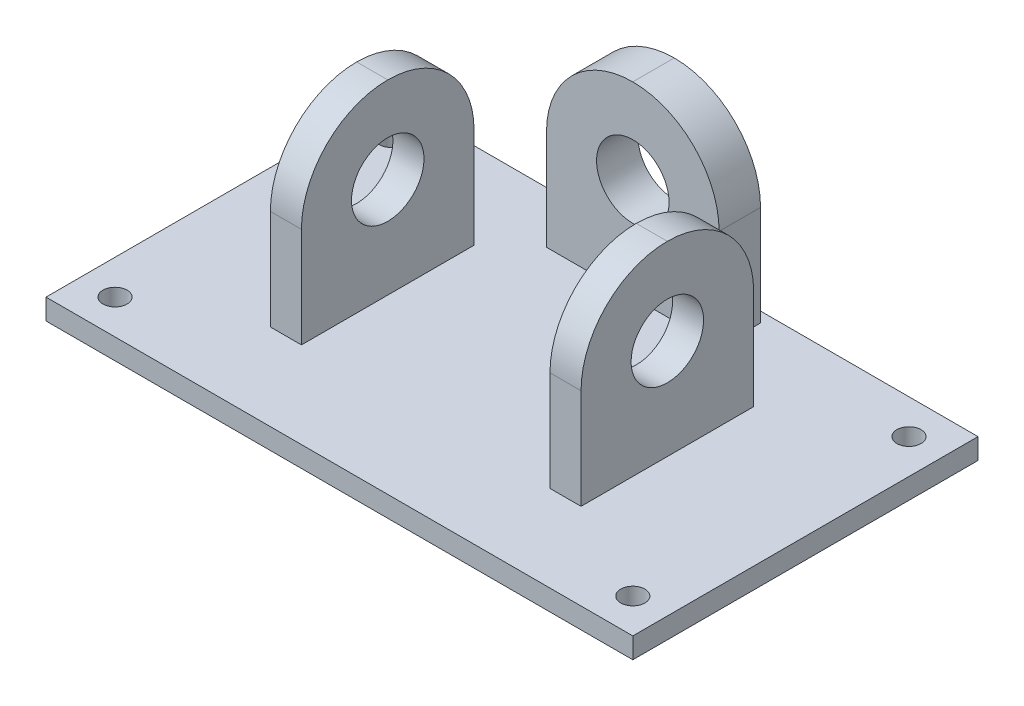
ISO-10303-21;
HEADER;
FILE_DESCRIPTION(('STEP AP214'),'2;1');
FILE_NAME('part.step','',(''),(''),'','','');
FILE_SCHEMA(('AUTOMOTIVE_DESIGN { 1 0 10303 214 1 1 1 1 }'));
ENDSEC;
DATA;
#1=APPLICATION_CONTEXT('core data for automotive mechanical design processes');
#2=APPLICATION_PROTOCOL_DEFINITION('international standard','automotive_design',2000,#1);
#3=PRODUCT_CONTEXT('',#1,'mechanical');
#4=PRODUCT('Part','Part','',(#3));
#5=PRODUCT_RELATED_PRODUCT_CATEGORY('part','',(#4));
#6=PRODUCT_DEFINITION_FORMATION('','',#4);
#7=PRODUCT_DEFINITION_CONTEXT('part definition',#1,'design');
#8=PRODUCT_DEFINITION('design','',#6,#7);
#9=PRODUCT_DEFINITION_SHAPE('','',#8);
#10=(LENGTH_UNIT() NAMED_UNIT(*) SI_UNIT(.MILLI.,.METRE.));
#11=(NAMED_UNIT(*) PLANE_ANGLE_UNIT() SI_UNIT($,.RADIAN.));
#12=(NAMED_UNIT(*) SI_UNIT($,.STERADIAN.) SOLID_ANGLE_UNIT());
#13=UNCERTAINTY_MEASURE_WITH_UNIT(LENGTH_MEASURE(1.E-05),#10,'distance_accuracy_value','');
#14=(GEOMETRIC_REPRESENTATION_CONTEXT(3) GLOBAL_UNCERTAINTY_ASSIGNED_CONTEXT((#13)) GLOBAL_UNIT_ASSIGNED_CONTEXT((#10,
#11,#12)) REPRESENTATION_CONTEXT('',''));
#15=CARTESIAN_POINT('',(0.,0.,0.));
#16=DIRECTION('',(0.,0.,1.));
#17=DIRECTION('',(1.,0.,0.));
#18=AXIS2_PLACEMENT_3D('',#15,#16,#17);
#19=CARTESIAN_POINT('',(0.,3.,0.));
#20=DIRECTION('',(0.,-1.,0.));
#21=DIRECTION('',(0.,0.,-1.));
#22=AXIS2_PLACEMENT_3D('',#19,#20,#21);
#23=PLANE('',#22);
#24=CARTESIAN_POINT('',(37.5,3.,-20.));
#25=DIRECTION('',(0.,1.,0.));
#26=DIRECTION('',(0.,0.,1.));
#27=AXIS2_PLACEMENT_3D('',#24,#25,#26);
#28=CIRCLE('',#27,1.75);
#29=CARTESIAN_POINT('',(37.5,3.,-18.25));
#30=VERTEX_POINT('',#29);
#31=EDGE_CURVE('E657',#30,#30,#28,.T.);
#32=ORIENTED_EDGE('',*,*,#31,.F.);
#33=EDGE_LOOP('',(#32));
#34=FACE_BOUND('',#33,.T.);
#35=CARTESIAN_POINT('',(37.5,3.,20.));
#36=DIRECTION('',(0.,1.,0.));
#37=DIRECTION('',(0.,0.,1.));
#38=AXIS2_PLACEMENT_3D('',#35,#36,#37);
#39=CIRCLE('',#38,1.75);
#40=CARTESIAN_POINT('',(37.5,3.,21.75));
#41=VERTEX_POINT('',#40);
#42=EDGE_CURVE('E665',#41,#41,#39,.T.);
#43=ORIENTED_EDGE('',*,*,#42,.F.);
#44=EDGE_LOOP('',(#43));
#45=FACE_BOUND('',#44,.T.);
#46=CARTESIAN_POINT('',(-37.5,3.,20.));
#47=DIRECTION('',(0.,1.,0.));
#48=DIRECTION('',(0.,0.,1.));
#49=AXIS2_PLACEMENT_3D('',#46,#47,#48);
#50=CIRCLE('',#49,1.75);
#51=CARTESIAN_POINT('',(-37.5,3.,21.75));
#52=VERTEX_POINT('',#51);
#53=EDGE_CURVE('E671',#52,#52,#50,.T.);
#54=ORIENTED_EDGE('',*,*,#53,.F.);
#55=EDGE_LOOP('',(#54));
#56=FACE_BOUND('',#55,.T.);
#57=DIRECTION('',(0.,0.,-1.));
#58=VECTOR('',#57,1.);
#59=CARTESIAN_POINT('',(12.5,3.,-17.5));
#60=LINE('',#59,#58);
#61=CARTESIAN_POINT('',(12.5,3.,-17.5));
#62=VERTEX_POINT('',#61);
#63=CARTESIAN_POINT('',(12.5,3.,-23.5));
#64=VERTEX_POINT('',#63);
#65=EDGE_CURVE('E196',#62,#64,#60,.T.);
#66=ORIENTED_EDGE('',*,*,#65,.F.);
#67=DIRECTION('',(1.,0.,0.));
#68=VECTOR('',#67,1.);
#69=CARTESIAN_POINT('',(-12.5,3.,-17.5));
#70=LINE('',#69,#68);
#71=CARTESIAN_POINT('',(-12.5,3.,-17.5));
#72=VERTEX_POINT('',#71);
#73=EDGE_CURVE('E205',#72,#62,#70,.T.);
#74=ORIENTED_EDGE('',*,*,#73,.F.);
#75=DIRECTION('',(0.,0.,1.));
#76=VECTOR('',#75,1.);
#77=CARTESIAN_POINT('',(-12.5,3.,-17.5));
#78=LINE('',#77,#76);
#79=CARTESIAN_POINT('',(-12.5,3.,-23.5));
#80=VERTEX_POINT('',#79);
#81=EDGE_CURVE('E202',#80,#72,#78,.T.);
#82=ORIENTED_EDGE('',*,*,#81,.F.);
#83=DIRECTION('',(-1.,0.,0.));
#84=VECTOR('',#83,1.);
#85=CARTESIAN_POINT('',(-12.5,3.,-23.5));
#86=LINE('',#85,#84);
#87=EDGE_CURVE('E199',#64,#80,#86,.T.);
#88=ORIENTED_EDGE('',*,*,#87,.F.);
#89=EDGE_LOOP('',(#66,#74,#82,#88));
#90=FACE_BOUND('',#89,.T.);
#91=DIRECTION('',(0.,0.,-1.));
#92=VECTOR('',#91,1.);
#93=CARTESIAN_POINT('',(42.5,3.,25.));
#94=LINE('',#93,#92);
#95=CARTESIAN_POINT('',(42.5,3.,25.));
#96=VERTEX_POINT('',#95);
#97=CARTESIAN_POINT('',(42.5,3.,-25.));
#98=VERTEX_POINT('',#97);
#99=EDGE_CURVE('E237',#96,#98,#94,.T.);
#100=ORIENTED_EDGE('',*,*,#99,.T.);
#101=DIRECTION('',(-1.,0.,0.));
#102=VECTOR('',#101,1.);
#103=CARTESIAN_POINT('',(-42.5,3.,-25.));
#104=LINE('',#103,#102);
#105=CARTESIAN_POINT('',(-42.5,3.,-25.));
#106=VERTEX_POINT('',#105);
#107=EDGE_CURVE('E240',#98,#106,#104,.T.);
#108=ORIENTED_EDGE('',*,*,#107,.T.);
#109=DIRECTION('',(0.,0.,1.));
#110=VECTOR('',#109,1.);
#111=CARTESIAN_POINT('',(-42.5,3.,25.));
#112=LINE('',#111,#110);
#113=CARTESIAN_POINT('',(-42.5,3.,25.));
#114=VERTEX_POINT('',#113);
#115=EDGE_CURVE('E243',#106,#114,#112,.T.);
#116=ORIENTED_EDGE('',*,*,#115,.T.);
#117=DIRECTION('',(1.,0.,0.));
#118=VECTOR('',#117,1.);
#119=CARTESIAN_POINT('',(-42.5,3.,25.));
#120=LINE('',#119,#118);
#121=EDGE_CURVE('E245',#114,#96,#120,.T.);
#122=ORIENTED_EDGE('',*,*,#121,.T.);
#123=EDGE_LOOP('',(#100,#108,#116,#122));
#124=FACE_BOUND('',#123,.T.);
#125=DIRECTION('',(0.,0.,-1.));
#126=VECTOR('',#125,1.);
#127=CARTESIAN_POINT('',(-18.,3.,-12.5));
#128=LINE('',#127,#126);
#129=CARTESIAN_POINT('',(-18.,3.,12.5));
#130=VERTEX_POINT('',#129);
#131=CARTESIAN_POINT('',(-18.,3.,-12.5));
#132=VERTEX_POINT('',#131);
#133=EDGE_CURVE('E216',#130,#132,#128,.T.);
#134=ORIENTED_EDGE('',*,*,#133,.F.);
#135=DIRECTION('',(1.,0.,0.));
#136=VECTOR('',#135,1.);
#137=CARTESIAN_POINT('',(-22.5,3.,12.5));
#138=LINE('',#137,#136);
#139=CARTESIAN_POINT('',(-22.5,3.,12.5));
#140=VERTEX_POINT('',#139);
#141=EDGE_CURVE('E225',#140,#130,#138,.T.);
#142=ORIENTED_EDGE('',*,*,#141,.F.);
#143=DIRECTION('',(0.,0.,1.));
#144=VECTOR('',#143,1.);
#145=CARTESIAN_POINT('',(-22.5,3.,-12.5));
#146=LINE('',#145,#144);
#147=CARTESIAN_POINT('',(-22.5,3.,-12.5));
#148=VERTEX_POINT('',#147);
#149=EDGE_CURVE('E222',#148,#140,#146,.T.);
#150=ORIENTED_EDGE('',*,*,#149,.F.);
#151=DIRECTION('',(-1.,0.,0.));
#152=VECTOR('',#151,1.);
#153=CARTESIAN_POINT('',(-22.5,3.,-12.5));
#154=LINE('',#153,#152);
#155=EDGE_CURVE('E219',#132,#148,#154,.T.);
#156=ORIENTED_EDGE('',*,*,#155,.F.);
#157=EDGE_LOOP('',(#134,#142,#150,#156));
#158=FACE_BOUND('',#157,.T.);
#159=DIRECTION('',(0.,0.,-1.));
#160=VECTOR('',#159,1.);
#161=CARTESIAN_POINT('',(22.5,3.,-12.5));
#162=LINE('',#161,#160);
#163=CARTESIAN_POINT('',(22.5,3.,12.5));
#164=VERTEX_POINT('',#163);
#165=CARTESIAN_POINT('',(22.5,3.,-12.5));
#166=VERTEX_POINT('',#165);
#167=EDGE_CURVE('E167',#164,#166,#162,.T.);
#168=ORIENTED_EDGE('',*,*,#167,.F.);
#169=DIRECTION('',(1.,0.,0.));
#170=VECTOR('',#169,1.);
#171=CARTESIAN_POINT('',(22.5,3.,12.5));
#172=LINE('',#171,#170);
#173=CARTESIAN_POINT('',(18.,3.,12.5));
#174=VERTEX_POINT('',#173);
#175=EDGE_CURVE('E172',#174,#164,#172,.T.);
#176=ORIENTED_EDGE('',*,*,#175,.F.);
#177=DIRECTION('',(0.,0.,1.));
#178=VECTOR('',#177,1.);
#179=CARTESIAN_POINT('',(18.,3.,-12.5));
#180=LINE('',#179,#178);
#181=CARTESIAN_POINT('',(18.,3.,-12.5));
#182=VERTEX_POINT('',#181);
#183=EDGE_CURVE('E186',#182,#174,#180,.T.);
#184=ORIENTED_EDGE('',*,*,#183,.F.);
#185=DIRECTION('',(-1.,0.,0.));
#186=VECTOR('',#185,1.);
#187=CARTESIAN_POINT('',(22.5,3.,-12.5));
#188=LINE('',#187,#186);
#189=EDGE_CURVE('E181',#166,#182,#188,.T.);
#190=ORIENTED_EDGE('',*,*,#189,.F.);
#191=EDGE_LOOP('',(#168,#176,#184,#190));
#192=FACE_BOUND('',#191,.T.);
#193=CARTESIAN_POINT('',(-37.5,3.,-20.));
#194=DIRECTION('',(0.,1.,0.));
#195=DIRECTION('',(0.,0.,1.));
#196=AXIS2_PLACEMENT_3D('',#193,#194,#195);
#197=CIRCLE('',#196,1.75);
#198=CARTESIAN_POINT('',(-37.5,3.,-18.25));
#199=VERTEX_POINT('',#198);
#200=EDGE_CURVE('E655',#199,#199,#197,.T.);
#201=ORIENTED_EDGE('',*,*,#200,.F.);
#202=EDGE_LOOP('',(#201));
#203=FACE_BOUND('',#202,.T.);
#204=ADVANCED_FACE('F37',(#34,#45,#56,#90,#124,#158,#192,#203),#23,.F.);
#205=CARTESIAN_POINT('',(42.5,3.,25.));
#206=DIRECTION('',(-1.,0.,0.));
#207=DIRECTION('',(0.,0.,1.));
#208=AXIS2_PLACEMENT_3D('',#205,#206,#207);
#209=PLANE('',#208);
#210=DIRECTION('',(0.,0.,-1.));
#211=VECTOR('',#210,1.);
#212=CARTESIAN_POINT('',(42.5,0.,25.));
#213=LINE('',#212,#211);
#214=CARTESIAN_POINT('',(42.5,0.,25.));
#215=VERTEX_POINT('',#214);
#216=CARTESIAN_POINT('',(42.5,0.,-25.));
#217=VERTEX_POINT('',#216);
#218=EDGE_CURVE('E236',#215,#217,#213,.T.);
#219=ORIENTED_EDGE('',*,*,#218,.T.);
#220=DIRECTION('',(0.,-1.,0.));
#221=VECTOR('',#220,1.);
#222=CARTESIAN_POINT('',(42.5,3.,-25.));
#223=LINE('',#222,#221);
#224=EDGE_CURVE('E263',#98,#217,#223,.T.);
#225=ORIENTED_EDGE('',*,*,#224,.F.);
#226=ORIENTED_EDGE('',*,*,#99,.F.);
#227=DIRECTION('',(0.,-1.,0.));
#228=VECTOR('',#227,1.);
#229=CARTESIAN_POINT('',(42.5,3.,25.));
#230=LINE('',#229,#228);
#231=EDGE_CURVE('E247',#96,#215,#230,.T.);
#232=ORIENTED_EDGE('',*,*,#231,.T.);
#233=EDGE_LOOP('',(#219,#225,#226,#232));
#234=FACE_BOUND('',#233,.T.);
#235=ADVANCED_FACE('F339',(#234),#209,.F.);
#236=CARTESIAN_POINT('',(-42.5,3.,-25.));
#237=DIRECTION('',(0.,0.,1.));
#238=DIRECTION('',(1.,0.,0.));
#239=AXIS2_PLACEMENT_3D('',#236,#237,#238);
#240=PLANE('',#239);
#241=DIRECTION('',(-1.,0.,0.));
#242=VECTOR('',#241,1.);
#243=CARTESIAN_POINT('',(-42.5,0.,-25.));
#244=LINE('',#243,#242);
#245=CARTESIAN_POINT('',(-42.5,0.,-25.));
#246=VERTEX_POINT('',#245);
#247=EDGE_CURVE('E250',#217,#246,#244,.T.);
#248=ORIENTED_EDGE('',*,*,#247,.T.);
#249=DIRECTION('',(0.,-1.,0.));
#250=VECTOR('',#249,1.);
#251=CARTESIAN_POINT('',(-42.5,3.,-25.));
#252=LINE('',#251,#250);
#253=EDGE_CURVE('E260',#106,#246,#252,.T.);
#254=ORIENTED_EDGE('',*,*,#253,.F.);
#255=ORIENTED_EDGE('',*,*,#107,.F.);
#256=ORIENTED_EDGE('',*,*,#224,.T.);
#257=EDGE_LOOP('',(#248,#254,#255,#256));
#258=FACE_BOUND('',#257,.T.);
#259=ADVANCED_FACE('F345',(#258),#240,.F.);
#260=CARTESIAN_POINT('',(-42.5,3.,25.));
#261=DIRECTION('',(1.,0.,0.));
#262=DIRECTION('',(0.,0.,-1.));
#263=AXIS2_PLACEMENT_3D('',#260,#261,#262);
#264=PLANE('',#263);
#265=DIRECTION('',(0.,0.,1.));
#266=VECTOR('',#265,1.);
#267=CARTESIAN_POINT('',(-42.5,0.,25.));
#268=LINE('',#267,#266);
#269=CARTESIAN_POINT('',(-42.5,0.,25.));
#270=VERTEX_POINT('',#269);
#271=EDGE_CURVE('E252',#246,#270,#268,.T.);
#272=ORIENTED_EDGE('',*,*,#271,.T.);
#273=DIRECTION('',(0.,-1.,0.));
#274=VECTOR('',#273,1.);
#275=CARTESIAN_POINT('',(-42.5,3.,25.));
#276=LINE('',#275,#274);
#277=EDGE_CURVE('E257',#114,#270,#276,.T.);
#278=ORIENTED_EDGE('',*,*,#277,.F.);
#279=ORIENTED_EDGE('',*,*,#115,.F.);
#280=ORIENTED_EDGE('',*,*,#253,.T.);
#281=EDGE_LOOP('',(#272,#278,#279,#280));
#282=FACE_BOUND('',#281,.T.);
#283=ADVANCED_FACE('F361',(#282),#264,.F.);
#284=CARTESIAN_POINT('',(-42.5,3.,25.));
#285=DIRECTION('',(0.,0.,-1.));
#286=DIRECTION('',(-1.,0.,0.));
#287=AXIS2_PLACEMENT_3D('',#284,#285,#286);
#288=PLANE('',#287);
#289=DIRECTION('',(1.,0.,0.));
#290=VECTOR('',#289,1.);
#291=CARTESIAN_POINT('',(-42.5,0.,25.));
#292=LINE('',#291,#290);
#293=EDGE_CURVE('E241',#270,#215,#292,.T.);
#294=ORIENTED_EDGE('',*,*,#293,.T.);
#295=ORIENTED_EDGE('',*,*,#231,.F.);
#296=ORIENTED_EDGE('',*,*,#121,.F.);
#297=ORIENTED_EDGE('',*,*,#277,.T.);
#298=EDGE_LOOP('',(#294,#295,#296,#297));
#299=FACE_BOUND('',#298,.T.);
#300=ADVANCED_FACE('F357',(#299),#288,.F.);
#301=CARTESIAN_POINT('',(0.,0.,0.));
#302=DIRECTION('',(0.,-1.,0.));
#303=DIRECTION('',(0.,0.,-1.));
#304=AXIS2_PLACEMENT_3D('',#301,#302,#303);
#305=PLANE('',#304);
#306=CARTESIAN_POINT('',(-37.5,0.,-20.));
#307=DIRECTION('',(0.,-1.,0.));
#308=DIRECTION('',(0.,0.,-1.));
#309=AXIS2_PLACEMENT_3D('',#306,#307,#308);
#310=CIRCLE('',#309,1.75);
#311=CARTESIAN_POINT('',(-37.5,0.,-21.75));
#312=VERTEX_POINT('',#311);
#313=EDGE_CURVE('E652',#312,#312,#310,.T.);
#314=ORIENTED_EDGE('',*,*,#313,.F.);
#315=EDGE_LOOP('',(#314));
#316=FACE_BOUND('',#315,.T.);
#317=CARTESIAN_POINT('',(37.5,0.,-20.));
#318=DIRECTION('',(0.,-1.,0.));
#319=DIRECTION('',(0.,0.,-1.));
#320=AXIS2_PLACEMENT_3D('',#317,#318,#319);
#321=CIRCLE('',#320,1.75);
#322=CARTESIAN_POINT('',(37.5,0.,-21.75));
#323=VERTEX_POINT('',#322);
#324=EDGE_CURVE('E662',#323,#323,#321,.T.);
#325=ORIENTED_EDGE('',*,*,#324,.F.);
#326=EDGE_LOOP('',(#325));
#327=FACE_BOUND('',#326,.T.);
#328=CARTESIAN_POINT('',(37.5,0.,20.));
#329=DIRECTION('',(0.,-1.,0.));
#330=DIRECTION('',(0.,0.,-1.));
#331=AXIS2_PLACEMENT_3D('',#328,#329,#330);
#332=CIRCLE('',#331,1.75);
#333=CARTESIAN_POINT('',(37.5,0.,18.25));
#334=VERTEX_POINT('',#333);
#335=EDGE_CURVE('E668',#334,#334,#332,.T.);
#336=ORIENTED_EDGE('',*,*,#335,.F.);
#337=EDGE_LOOP('',(#336));
#338=FACE_BOUND('',#337,.T.);
#339=CARTESIAN_POINT('',(-37.5,0.,20.));
#340=DIRECTION('',(0.,-1.,0.));
#341=DIRECTION('',(0.,0.,-1.));
#342=AXIS2_PLACEMENT_3D('',#339,#340,#341);
#343=CIRCLE('',#342,1.75);
#344=CARTESIAN_POINT('',(-37.5,0.,18.25));
#345=VERTEX_POINT('',#344);
#346=EDGE_CURVE('E674',#345,#345,#343,.T.);
#347=ORIENTED_EDGE('',*,*,#346,.F.);
#348=EDGE_LOOP('',(#347));
#349=FACE_BOUND('',#348,.T.);
#350=ORIENTED_EDGE('',*,*,#218,.F.);
#351=ORIENTED_EDGE('',*,*,#293,.F.);
#352=ORIENTED_EDGE('',*,*,#271,.F.);
#353=ORIENTED_EDGE('',*,*,#247,.F.);
#354=EDGE_LOOP('',(#350,#351,#352,#353));
#355=FACE_BOUND('',#354,.T.);
#356=ADVANCED_FACE('F354',(#316,#327,#338,#349,#355),#305,.T.);
#357=CARTESIAN_POINT('',(-18.,30.,-12.5));
#358=DIRECTION('',(-1.,0.,0.));
#359=DIRECTION('',(0.,0.,1.));
#360=AXIS2_PLACEMENT_3D('',#357,#358,#359);
#361=PLANE('',#360);
#362=CARTESIAN_POINT('',(-18.,17.5,0.));
#363=DIRECTION('',(-1.,0.,0.));
#364=DIRECTION('',(0.,0.,1.));
#365=AXIS2_PLACEMENT_3D('',#362,#363,#364);
#366=CIRCLE('',#365,5.25);
#367=CARTESIAN_POINT('',(-18.,17.5,5.25));
#368=VERTEX_POINT('',#367);
#369=EDGE_CURVE('E307',#368,#368,#366,.T.);
#370=ORIENTED_EDGE('',*,*,#369,.T.);
#371=EDGE_LOOP('',(#370));
#372=FACE_BOUND('',#371,.T.);
#373=DIRECTION('',(0.,-1.,0.));
#374=VECTOR('',#373,1.);
#375=CARTESIAN_POINT('',(-18.,30.,-12.5));
#376=LINE('',#375,#374);
#377=CARTESIAN_POINT('',(-18.,17.5,-12.5));
#378=VERTEX_POINT('',#377);
#379=EDGE_CURVE('E234',#378,#132,#376,.T.);
#380=ORIENTED_EDGE('',*,*,#379,.F.);
#381=CARTESIAN_POINT('',(-18.,17.5,0.));
#382=DIRECTION('',(-1.,0.,0.));
#383=DIRECTION('',(0.,0.,1.));
#384=AXIS2_PLACEMENT_3D('',#381,#382,#383);
#385=CIRCLE('',#384,12.5);
#386=CARTESIAN_POINT('',(-18.,30.,0.));
#387=VERTEX_POINT('',#386);
#388=EDGE_CURVE('E275',#378,#387,#385,.F.);
#389=ORIENTED_EDGE('',*,*,#388,.T.);
#390=CARTESIAN_POINT('',(-18.,17.5,0.));
#391=DIRECTION('',(-1.,0.,0.));
#392=DIRECTION('',(0.,0.,1.));
#393=AXIS2_PLACEMENT_3D('',#390,#391,#392);
#394=CIRCLE('',#393,12.5);
#395=CARTESIAN_POINT('',(-18.,17.5,12.5));
#396=VERTEX_POINT('',#395);
#397=EDGE_CURVE('E273',#387,#396,#394,.F.);
#398=ORIENTED_EDGE('',*,*,#397,.T.);
#399=DIRECTION('',(0.,-1.,0.));
#400=VECTOR('',#399,1.);
#401=CARTESIAN_POINT('',(-18.,30.,12.5));
#402=LINE('',#401,#400);
#403=EDGE_CURVE('E228',#396,#130,#402,.T.);
#404=ORIENTED_EDGE('',*,*,#403,.T.);
#405=ORIENTED_EDGE('',*,*,#133,.T.);
#406=EDGE_LOOP('',(#380,#389,#398,#404,#405));
#407=FACE_BOUND('',#406,.T.);
#408=ADVANCED_FACE('F352',(#372,#407),#361,.F.);
#409=CARTESIAN_POINT('',(-22.5,30.,-12.5));
#410=DIRECTION('',(0.,0.,1.));
#411=DIRECTION('',(1.,0.,0.));
#412=AXIS2_PLACEMENT_3D('',#409,#410,#411);
#413=PLANE('',#412);
#414=DIRECTION('',(0.,-1.,0.));
#415=VECTOR('',#414,1.);
#416=CARTESIAN_POINT('',(-22.5,30.,-12.5));
#417=LINE('',#416,#415);
#418=CARTESIAN_POINT('',(-22.5,17.5,-12.5));
#419=VERTEX_POINT('',#418);
#420=EDGE_CURVE('E232',#419,#148,#417,.T.);
#421=ORIENTED_EDGE('',*,*,#420,.F.);
#422=DIRECTION('',(-1.,0.,0.));
#423=VECTOR('',#422,1.);
#424=CARTESIAN_POINT('',(-18.,17.5,-12.5));
#425=LINE('',#424,#423);
#426=EDGE_CURVE('E270',#419,#378,#425,.F.);
#427=ORIENTED_EDGE('',*,*,#426,.T.);
#428=ORIENTED_EDGE('',*,*,#379,.T.);
#429=ORIENTED_EDGE('',*,*,#155,.T.);
#430=EDGE_LOOP('',(#421,#427,#428,#429));
#431=FACE_BOUND('',#430,.T.);
#432=ADVANCED_FACE('F423',(#431),#413,.F.);
#433=CARTESIAN_POINT('',(-22.5,30.,-12.5));
#434=DIRECTION('',(1.,0.,0.));
#435=DIRECTION('',(0.,0.,-1.));
#436=AXIS2_PLACEMENT_3D('',#433,#434,#435);
#437=PLANE('',#436);
#438=CARTESIAN_POINT('',(-22.5,17.5,0.));
#439=DIRECTION('',(-1.,0.,0.));
#440=DIRECTION('',(0.,0.,1.));
#441=AXIS2_PLACEMENT_3D('',#438,#439,#440);
#442=CIRCLE('',#441,5.25);
#443=CARTESIAN_POINT('',(-22.5,17.5,5.25));
#444=VERTEX_POINT('',#443);
#445=EDGE_CURVE('E681',#444,#444,#442,.T.);
#446=ORIENTED_EDGE('',*,*,#445,.F.);
#447=EDGE_LOOP('',(#446));
#448=FACE_BOUND('',#447,.T.);
#449=CARTESIAN_POINT('',(-22.5,17.5,0.));
#450=DIRECTION('',(1.,0.,0.));
#451=DIRECTION('',(0.,0.,-1.));
#452=AXIS2_PLACEMENT_3D('',#449,#450,#451);
#453=CIRCLE('',#452,12.5);
#454=CARTESIAN_POINT('',(-22.5,17.5,12.5));
#455=VERTEX_POINT('',#454);
#456=CARTESIAN_POINT('',(-22.5,30.,0.));
#457=VERTEX_POINT('',#456);
#458=EDGE_CURVE('E266',#455,#457,#453,.F.);
#459=ORIENTED_EDGE('',*,*,#458,.T.);
#460=CARTESIAN_POINT('',(-22.5,17.5,0.));
#461=DIRECTION('',(1.,0.,0.));
#462=DIRECTION('',(0.,0.,-1.));
#463=AXIS2_PLACEMENT_3D('',#460,#461,#462);
#464=CIRCLE('',#463,12.5);
#465=EDGE_CURVE('E268',#457,#419,#464,.F.);
#466=ORIENTED_EDGE('',*,*,#465,.T.);
#467=ORIENTED_EDGE('',*,*,#420,.T.);
#468=ORIENTED_EDGE('',*,*,#149,.T.);
#469=DIRECTION('',(0.,-1.,0.));
#470=VECTOR('',#469,1.);
#471=CARTESIAN_POINT('',(-22.5,30.,12.5));
#472=LINE('',#471,#470);
#473=EDGE_CURVE('E230',#455,#140,#472,.T.);
#474=ORIENTED_EDGE('',*,*,#473,.F.);
#475=EDGE_LOOP('',(#459,#466,#467,#468,#474));
#476=FACE_BOUND('',#475,.T.);
#477=ADVANCED_FACE('F420',(#448,#476),#437,.F.);
#478=CARTESIAN_POINT('',(-22.5,30.,12.5));
#479=DIRECTION('',(0.,0.,-1.));
#480=DIRECTION('',(-1.,0.,0.));
#481=AXIS2_PLACEMENT_3D('',#478,#479,#480);
#482=PLANE('',#481);
#483=ORIENTED_EDGE('',*,*,#403,.F.);
#484=DIRECTION('',(1.,0.,0.));
#485=VECTOR('',#484,1.);
#486=CARTESIAN_POINT('',(-22.5,17.5,12.5));
#487=LINE('',#486,#485);
#488=EDGE_CURVE('E277',#396,#455,#487,.F.);
#489=ORIENTED_EDGE('',*,*,#488,.T.);
#490=ORIENTED_EDGE('',*,*,#473,.T.);
#491=ORIENTED_EDGE('',*,*,#141,.T.);
#492=EDGE_LOOP('',(#483,#489,#490,#491));
#493=FACE_BOUND('',#492,.T.);
#494=ADVANCED_FACE('F413',(#493),#482,.F.);
#495=CARTESIAN_POINT('',(12.5,30.,-17.5));
#496=DIRECTION('',(-1.,0.,0.));
#497=DIRECTION('',(0.,0.,1.));
#498=AXIS2_PLACEMENT_3D('',#495,#496,#497);
#499=PLANE('',#498);
#500=DIRECTION('',(0.,-1.,0.));
#501=VECTOR('',#500,1.);
#502=CARTESIAN_POINT('',(12.5,30.,-23.5));
#503=LINE('',#502,#501);
#504=CARTESIAN_POINT('',(12.5,17.5,-23.5));
#505=VERTEX_POINT('',#504);
#506=EDGE_CURVE('E214',#505,#64,#503,.T.);
#507=ORIENTED_EDGE('',*,*,#506,.F.);
#508=DIRECTION('',(0.,0.,-1.));
#509=VECTOR('',#508,1.);
#510=CARTESIAN_POINT('',(12.5,17.5,-17.5));
#511=LINE('',#510,#509);
#512=CARTESIAN_POINT('',(12.5,17.5,-17.5));
#513=VERTEX_POINT('',#512);
#514=EDGE_CURVE('E290',#505,#513,#511,.F.);
#515=ORIENTED_EDGE('',*,*,#514,.T.);
#516=DIRECTION('',(0.,-1.,0.));
#517=VECTOR('',#516,1.);
#518=CARTESIAN_POINT('',(12.5,30.,-17.5));
#519=LINE('',#518,#517);
#520=EDGE_CURVE('E208',#513,#62,#519,.T.);
#521=ORIENTED_EDGE('',*,*,#520,.T.);
#522=ORIENTED_EDGE('',*,*,#65,.T.);
#523=EDGE_LOOP('',(#507,#515,#521,#522));
#524=FACE_BOUND('',#523,.T.);
#525=ADVANCED_FACE('F388',(#524),#499,.F.);
#526=CARTESIAN_POINT('',(-12.5,30.,-23.5));
#527=DIRECTION('',(0.,0.,1.));
#528=DIRECTION('',(1.,0.,0.));
#529=AXIS2_PLACEMENT_3D('',#526,#527,#528);
#530=PLANE('',#529);
#531=CARTESIAN_POINT('',(0.,17.5,-23.5));
#532=DIRECTION('',(0.,0.,1.));
#533=DIRECTION('',(1.,0.,0.));
#534=AXIS2_PLACEMENT_3D('',#531,#532,#533);
#535=CIRCLE('',#534,5.25);
#536=CARTESIAN_POINT('',(5.25,17.5,-23.5));
#537=VERTEX_POINT('',#536);
#538=EDGE_CURVE('E680',#537,#537,#535,.T.);
#539=ORIENTED_EDGE('',*,*,#538,.T.);
#540=EDGE_LOOP('',(#539));
#541=FACE_BOUND('',#540,.T.);
#542=DIRECTION('',(0.,-1.,0.));
#543=VECTOR('',#542,1.);
#544=CARTESIAN_POINT('',(-12.5,30.,-23.5));
#545=LINE('',#544,#543);
#546=CARTESIAN_POINT('',(-12.5,17.5,-23.5));
#547=VERTEX_POINT('',#546);
#548=EDGE_CURVE('E212',#547,#80,#545,.T.);
#549=ORIENTED_EDGE('',*,*,#548,.F.);
#550=CARTESIAN_POINT('',(0.,17.5,-23.5));
#551=DIRECTION('',(0.,0.,1.));
#552=DIRECTION('',(1.,0.,0.));
#553=AXIS2_PLACEMENT_3D('',#550,#551,#552);
#554=CIRCLE('',#553,12.5);
#555=CARTESIAN_POINT('',(0.,30.,-23.5));
#556=VERTEX_POINT('',#555);
#557=EDGE_CURVE('E288',#547,#556,#554,.F.);
#558=ORIENTED_EDGE('',*,*,#557,.T.);
#559=CARTESIAN_POINT('',(0.,17.5,-23.5));
#560=DIRECTION('',(0.,0.,1.));
#561=DIRECTION('',(1.,0.,0.));
#562=AXIS2_PLACEMENT_3D('',#559,#560,#561);
#563=CIRCLE('',#562,12.5);
#564=EDGE_CURVE('E286',#556,#505,#563,.F.);
#565=ORIENTED_EDGE('',*,*,#564,.T.);
#566=ORIENTED_EDGE('',*,*,#506,.T.);
#567=ORIENTED_EDGE('',*,*,#87,.T.);
#568=EDGE_LOOP('',(#549,#558,#565,#566,#567));
#569=FACE_BOUND('',#568,.T.);
#570=ADVANCED_FACE('F403',(#541,#569),#530,.F.);
#571=CARTESIAN_POINT('',(-12.5,30.,-17.5));
#572=DIRECTION('',(1.,0.,0.));
#573=DIRECTION('',(0.,0.,-1.));
#574=AXIS2_PLACEMENT_3D('',#571,#572,#573);
#575=PLANE('',#574);
#576=DIRECTION('',(0.,-1.,0.));
#577=VECTOR('',#576,1.);
#578=CARTESIAN_POINT('',(-12.5,30.,-17.5));
#579=LINE('',#578,#577);
#580=CARTESIAN_POINT('',(-12.5,17.5,-17.5));
#581=VERTEX_POINT('',#580);
#582=EDGE_CURVE('E210',#581,#72,#579,.T.);
#583=ORIENTED_EDGE('',*,*,#582,.F.);
#584=DIRECTION('',(0.,0.,1.));
#585=VECTOR('',#584,1.);
#586=CARTESIAN_POINT('',(-12.5,17.5,-17.5));
#587=LINE('',#586,#585);
#588=EDGE_CURVE('E283',#581,#547,#587,.F.);
#589=ORIENTED_EDGE('',*,*,#588,.T.);
#590=ORIENTED_EDGE('',*,*,#548,.T.);
#591=ORIENTED_EDGE('',*,*,#81,.T.);
#592=EDGE_LOOP('',(#583,#589,#590,#591));
#593=FACE_BOUND('',#592,.T.);
#594=ADVANCED_FACE('F399',(#593),#575,.F.);
#595=CARTESIAN_POINT('',(-12.5,30.,-17.5));
#596=DIRECTION('',(0.,0.,-1.));
#597=DIRECTION('',(-1.,0.,0.));
#598=AXIS2_PLACEMENT_3D('',#595,#596,#597);
#599=PLANE('',#598);
#600=CARTESIAN_POINT('',(0.,17.5,-17.5));
#601=DIRECTION('',(0.,0.,1.));
#602=DIRECTION('',(1.,0.,0.));
#603=AXIS2_PLACEMENT_3D('',#600,#601,#602);
#604=CIRCLE('',#603,5.25);
#605=CARTESIAN_POINT('',(5.25,17.5,-17.5));
#606=VERTEX_POINT('',#605);
#607=EDGE_CURVE('E677',#606,#606,#604,.T.);
#608=ORIENTED_EDGE('',*,*,#607,.F.);
#609=EDGE_LOOP('',(#608));
#610=FACE_BOUND('',#609,.T.);
#611=CARTESIAN_POINT('',(0.,17.5,-17.5));
#612=DIRECTION('',(0.,0.,-1.));
#613=DIRECTION('',(-1.,0.,0.));
#614=AXIS2_PLACEMENT_3D('',#611,#612,#613);
#615=CIRCLE('',#614,12.5);
#616=CARTESIAN_POINT('',(0.,30.,-17.5));
#617=VERTEX_POINT('',#616);
#618=EDGE_CURVE('E279',#513,#617,#615,.F.);
#619=ORIENTED_EDGE('',*,*,#618,.T.);
#620=CARTESIAN_POINT('',(0.,17.5,-17.5));
#621=DIRECTION('',(0.,0.,-1.));
#622=DIRECTION('',(-1.,0.,0.));
#623=AXIS2_PLACEMENT_3D('',#620,#621,#622);
#624=CIRCLE('',#623,12.5);
#625=EDGE_CURVE('E281',#617,#581,#624,.F.);
#626=ORIENTED_EDGE('',*,*,#625,.T.);
#627=ORIENTED_EDGE('',*,*,#582,.T.);
#628=ORIENTED_EDGE('',*,*,#73,.T.);
#629=ORIENTED_EDGE('',*,*,#520,.F.);
#630=EDGE_LOOP('',(#619,#626,#627,#628,#629));
#631=FACE_BOUND('',#630,.T.);
#632=ADVANCED_FACE('F391',(#610,#631),#599,.F.);
#633=CARTESIAN_POINT('',(22.5,30.,-12.5));
#634=DIRECTION('',(-1.,0.,0.));
#635=DIRECTION('',(0.,0.,1.));
#636=AXIS2_PLACEMENT_3D('',#633,#634,#635);
#637=PLANE('',#636);
#638=CARTESIAN_POINT('',(22.5,17.5,0.));
#639=DIRECTION('',(-1.,0.,0.));
#640=DIRECTION('',(0.,0.,1.));
#641=AXIS2_PLACEMENT_3D('',#638,#639,#640);
#642=CIRCLE('',#641,5.25);
#643=CARTESIAN_POINT('',(22.5,17.5,5.25));
#644=VERTEX_POINT('',#643);
#645=EDGE_CURVE('E312',#644,#644,#642,.T.);
#646=ORIENTED_EDGE('',*,*,#645,.T.);
#647=EDGE_LOOP('',(#646));
#648=FACE_BOUND('',#647,.T.);
#649=DIRECTION('',(0.,-1.,0.));
#650=VECTOR('',#649,1.);
#651=CARTESIAN_POINT('',(22.5,30.,-12.5));
#652=LINE('',#651,#650);
#653=CARTESIAN_POINT('',(22.5,17.5,-12.5));
#654=VERTEX_POINT('',#653);
#655=EDGE_CURVE('E194',#654,#166,#652,.T.);
#656=ORIENTED_EDGE('',*,*,#655,.F.);
#657=CARTESIAN_POINT('',(22.5,17.5,0.));
#658=DIRECTION('',(-1.,0.,0.));
#659=DIRECTION('',(0.,0.,1.));
#660=AXIS2_PLACEMENT_3D('',#657,#658,#659);
#661=CIRCLE('',#660,12.5);
#662=CARTESIAN_POINT('',(22.5,30.,0.));
#663=VERTEX_POINT('',#662);
#664=EDGE_CURVE('E46',#654,#663,#661,.F.);
#665=ORIENTED_EDGE('',*,*,#664,.T.);
#666=CARTESIAN_POINT('',(22.5,17.5,0.));
#667=DIRECTION('',(-1.,0.,0.));
#668=DIRECTION('',(0.,0.,1.));
#669=AXIS2_PLACEMENT_3D('',#666,#667,#668);
#670=CIRCLE('',#669,12.5);
#671=CARTESIAN_POINT('',(22.5,17.5,12.5));
#672=VERTEX_POINT('',#671);
#673=EDGE_CURVE('E54',#663,#672,#670,.F.);
#674=ORIENTED_EDGE('',*,*,#673,.T.);
#675=DIRECTION('',(0.,-1.,0.));
#676=VECTOR('',#675,1.);
#677=CARTESIAN_POINT('',(22.5,30.,12.5));
#678=LINE('',#677,#676);
#679=EDGE_CURVE('E164',#672,#164,#678,.T.);
#680=ORIENTED_EDGE('',*,*,#679,.T.);
#681=ORIENTED_EDGE('',*,*,#167,.T.);
#682=EDGE_LOOP('',(#656,#665,#674,#680,#681));
#683=FACE_BOUND('',#682,.T.);
#684=ADVANCED_FACE('F166',(#648,#683),#637,.F.);
#685=CARTESIAN_POINT('',(22.5,30.,-12.5));
#686=DIRECTION('',(0.,0.,1.));
#687=DIRECTION('',(1.,0.,0.));
#688=AXIS2_PLACEMENT_3D('',#685,#686,#687);
#689=PLANE('',#688);
#690=DIRECTION('',(0.,-1.,0.));
#691=VECTOR('',#690,1.);
#692=CARTESIAN_POINT('',(18.,30.,-12.5));
#693=LINE('',#692,#691);
#694=CARTESIAN_POINT('',(18.,17.5,-12.5));
#695=VERTEX_POINT('',#694);
#696=EDGE_CURVE('E192',#695,#182,#693,.T.);
#697=ORIENTED_EDGE('',*,*,#696,.F.);
#698=DIRECTION('',(-1.,0.,0.));
#699=VECTOR('',#698,1.);
#700=CARTESIAN_POINT('',(22.5,17.5,-12.5));
#701=LINE('',#700,#699);
#702=EDGE_CURVE('E296',#695,#654,#701,.F.);
#703=ORIENTED_EDGE('',*,*,#702,.T.);
#704=ORIENTED_EDGE('',*,*,#655,.T.);
#705=ORIENTED_EDGE('',*,*,#189,.T.);
#706=EDGE_LOOP('',(#697,#703,#704,#705));
#707=FACE_BOUND('',#706,.T.);
#708=ADVANCED_FACE('F321',(#707),#689,.F.);
#709=CARTESIAN_POINT('',(18.,30.,-12.5));
#710=DIRECTION('',(1.,0.,0.));
#711=DIRECTION('',(0.,0.,-1.));
#712=AXIS2_PLACEMENT_3D('',#709,#710,#711);
#713=PLANE('',#712);
#714=CARTESIAN_POINT('',(18.,17.5,0.));
#715=DIRECTION('',(1.,0.,0.));
#716=DIRECTION('',(0.,0.,-1.));
#717=AXIS2_PLACEMENT_3D('',#714,#715,#716);
#718=CIRCLE('',#717,5.25);
#719=CARTESIAN_POINT('',(18.,17.5,-5.25));
#720=VERTEX_POINT('',#719);
#721=EDGE_CURVE('E41',#720,#720,#718,.T.);
#722=ORIENTED_EDGE('',*,*,#721,.T.);
#723=EDGE_LOOP('',(#722));
#724=FACE_BOUND('',#723,.T.);
#725=CARTESIAN_POINT('',(18.,17.5,0.));
#726=DIRECTION('',(1.,0.,0.));
#727=DIRECTION('',(0.,0.,-1.));
#728=AXIS2_PLACEMENT_3D('',#725,#726,#727);
#729=CIRCLE('',#728,12.5);
#730=CARTESIAN_POINT('',(18.,17.5,12.5));
#731=VERTEX_POINT('',#730);
#732=CARTESIAN_POINT('',(18.,30.,0.));
#733=VERTEX_POINT('',#732);
#734=EDGE_CURVE('E292',#731,#733,#729,.F.);
#735=ORIENTED_EDGE('',*,*,#734,.T.);
#736=CARTESIAN_POINT('',(18.,17.5,0.));
#737=DIRECTION('',(1.,0.,0.));
#738=DIRECTION('',(0.,0.,-1.));
#739=AXIS2_PLACEMENT_3D('',#736,#737,#738);
#740=CIRCLE('',#739,12.5);
#741=EDGE_CURVE('E294',#733,#695,#740,.F.);
#742=ORIENTED_EDGE('',*,*,#741,.T.);
#743=ORIENTED_EDGE('',*,*,#696,.T.);
#744=ORIENTED_EDGE('',*,*,#183,.T.);
#745=DIRECTION('',(0.,-1.,0.));
#746=VECTOR('',#745,1.);
#747=CARTESIAN_POINT('',(18.,30.,12.5));
#748=LINE('',#747,#746);
#749=EDGE_CURVE('E171',#731,#174,#748,.T.);
#750=ORIENTED_EDGE('',*,*,#749,.F.);
#751=EDGE_LOOP('',(#735,#742,#743,#744,#750));
#752=FACE_BOUND('',#751,.T.);
#753=ADVANCED_FACE('F325',(#724,#752),#713,.F.);
#754=CARTESIAN_POINT('',(22.5,30.,12.5));
#755=DIRECTION('',(0.,0.,-1.));
#756=DIRECTION('',(-1.,0.,0.));
#757=AXIS2_PLACEMENT_3D('',#754,#755,#756);
#758=PLANE('',#757);
#759=ORIENTED_EDGE('',*,*,#679,.F.);
#760=DIRECTION('',(1.,0.,0.));
#761=VECTOR('',#760,1.);
#762=CARTESIAN_POINT('',(22.5,17.5,12.5));
#763=LINE('',#762,#761);
#764=EDGE_CURVE('E11',#672,#731,#763,.F.);
#765=ORIENTED_EDGE('',*,*,#764,.T.);
#766=ORIENTED_EDGE('',*,*,#749,.T.);
#767=ORIENTED_EDGE('',*,*,#175,.T.);
#768=EDGE_LOOP('',(#759,#765,#766,#767));
#769=FACE_BOUND('',#768,.T.);
#770=ADVANCED_FACE('F184',(#769),#758,.F.);
#771=CARTESIAN_POINT('',(0.,17.5,0.));
#772=DIRECTION('',(-1.,0.,0.));
#773=DIRECTION('',(0.,0.,1.));
#774=AXIS2_PLACEMENT_3D('',#771,#772,#773);
#775=CYLINDRICAL_SURFACE('',#774,12.5);
#776=ORIENTED_EDGE('',*,*,#488,.F.);
#777=ORIENTED_EDGE('',*,*,#397,.F.);
#778=DIRECTION('',(1.,0.,0.));
#779=VECTOR('',#778,1.);
#780=CARTESIAN_POINT('',(-18.,30.,0.));
#781=LINE('',#780,#779);
#782=EDGE_CURVE('E182',#457,#387,#781,.T.);
#783=ORIENTED_EDGE('',*,*,#782,.F.);
#784=ORIENTED_EDGE('',*,*,#458,.F.);
#785=EDGE_LOOP('',(#776,#777,#783,#784));
#786=FACE_BOUND('',#785,.T.);
#787=ADVANCED_FACE('F372',(#786),#775,.T.);
#788=CARTESIAN_POINT('',(0.,17.5,0.));
#789=DIRECTION('',(1.,0.,0.));
#790=DIRECTION('',(0.,0.,-1.));
#791=AXIS2_PLACEMENT_3D('',#788,#789,#790);
#792=CYLINDRICAL_SURFACE('',#791,12.5);
#793=ORIENTED_EDGE('',*,*,#388,.F.);
#794=ORIENTED_EDGE('',*,*,#426,.F.);
#795=ORIENTED_EDGE('',*,*,#465,.F.);
#796=ORIENTED_EDGE('',*,*,#782,.T.);
#797=EDGE_LOOP('',(#793,#794,#795,#796));
#798=FACE_BOUND('',#797,.T.);
#799=ADVANCED_FACE('F369',(#798),#792,.T.);
#800=CARTESIAN_POINT('',(0.,17.5,0.));
#801=DIRECTION('',(0.,0.,-1.));
#802=DIRECTION('',(-1.,0.,0.));
#803=AXIS2_PLACEMENT_3D('',#800,#801,#802);
#804=CYLINDRICAL_SURFACE('',#803,12.5);
#805=ORIENTED_EDGE('',*,*,#514,.F.);
#806=ORIENTED_EDGE('',*,*,#564,.F.);
#807=DIRECTION('',(0.,0.,-1.));
#808=VECTOR('',#807,1.);
#809=CARTESIAN_POINT('',(0.,30.,0.));
#810=LINE('',#809,#808);
#811=EDGE_CURVE('E303',#617,#556,#810,.T.);
#812=ORIENTED_EDGE('',*,*,#811,.F.);
#813=ORIENTED_EDGE('',*,*,#618,.F.);
#814=EDGE_LOOP('',(#805,#806,#812,#813));
#815=FACE_BOUND('',#814,.T.);
#816=ADVANCED_FACE('F335',(#815),#804,.T.);
#817=CARTESIAN_POINT('',(0.,17.5,0.));
#818=DIRECTION('',(0.,0.,1.));
#819=DIRECTION('',(1.,0.,0.));
#820=AXIS2_PLACEMENT_3D('',#817,#818,#819);
#821=CYLINDRICAL_SURFACE('',#820,12.5);
#822=ORIENTED_EDGE('',*,*,#557,.F.);
#823=ORIENTED_EDGE('',*,*,#588,.F.);
#824=ORIENTED_EDGE('',*,*,#625,.F.);
#825=ORIENTED_EDGE('',*,*,#811,.T.);
#826=EDGE_LOOP('',(#822,#823,#824,#825));
#827=FACE_BOUND('',#826,.T.);
#828=ADVANCED_FACE('F329',(#827),#821,.T.);
#829=CARTESIAN_POINT('',(0.,17.5,0.));
#830=DIRECTION('',(1.,0.,0.));
#831=DIRECTION('',(0.,0.,-1.));
#832=AXIS2_PLACEMENT_3D('',#829,#830,#831);
#833=CYLINDRICAL_SURFACE('',#832,12.5);
#834=ORIENTED_EDGE('',*,*,#764,.F.);
#835=ORIENTED_EDGE('',*,*,#673,.F.);
#836=DIRECTION('',(1.,0.,0.));
#837=VECTOR('',#836,1.);
#838=CARTESIAN_POINT('',(0.,30.,0.));
#839=LINE('',#838,#837);
#840=EDGE_CURVE('E305',#733,#663,#839,.T.);
#841=ORIENTED_EDGE('',*,*,#840,.F.);
#842=ORIENTED_EDGE('',*,*,#734,.F.);
#843=EDGE_LOOP('',(#834,#835,#841,#842));
#844=FACE_BOUND('',#843,.T.);
#845=ADVANCED_FACE('F39',(#844),#833,.T.);
#846=CARTESIAN_POINT('',(0.,17.5,0.));
#847=DIRECTION('',(-1.,0.,0.));
#848=DIRECTION('',(0.,0.,1.));
#849=AXIS2_PLACEMENT_3D('',#846,#847,#848);
#850=CYLINDRICAL_SURFACE('',#849,12.5);
#851=ORIENTED_EDGE('',*,*,#664,.F.);
#852=ORIENTED_EDGE('',*,*,#702,.F.);
#853=ORIENTED_EDGE('',*,*,#741,.F.);
#854=ORIENTED_EDGE('',*,*,#840,.T.);
#855=EDGE_LOOP('',(#851,#852,#853,#854));
#856=FACE_BOUND('',#855,.T.);
#857=ADVANCED_FACE('F323',(#856),#850,.T.);
#858=CARTESIAN_POINT('',(42.5,17.5,0.));
#859=DIRECTION('',(-1.,0.,0.));
#860=DIRECTION('',(0.,0.,1.));
#861=AXIS2_PLACEMENT_3D('',#858,#859,#860);
#862=CYLINDRICAL_SURFACE('',#861,5.25);
#863=ORIENTED_EDGE('',*,*,#721,.F.);
#864=EDGE_LOOP('',(#863));
#865=FACE_BOUND('',#864,.T.);
#866=ORIENTED_EDGE('',*,*,#645,.F.);
#867=EDGE_LOOP('',(#866));
#868=FACE_BOUND('',#867,.T.);
#869=ADVANCED_FACE('F334',(#865,#868),#862,.F.);
#870=ORIENTED_EDGE('',*,*,#445,.T.);
#871=EDGE_LOOP('',(#870));
#872=FACE_BOUND('',#871,.T.);
#873=ORIENTED_EDGE('',*,*,#369,.F.);
#874=EDGE_LOOP('',(#873));
#875=FACE_BOUND('',#874,.T.);
#876=ADVANCED_FACE('F585',(#872,#875),#862,.F.);
#877=CARTESIAN_POINT('',(0.,17.5,-25.));
#878=DIRECTION('',(0.,0.,1.));
#879=DIRECTION('',(1.,0.,0.));
#880=AXIS2_PLACEMENT_3D('',#877,#878,#879);
#881=CYLINDRICAL_SURFACE('',#880,5.25);
#882=ORIENTED_EDGE('',*,*,#607,.T.);
#883=EDGE_LOOP('',(#882));
#884=FACE_BOUND('',#883,.T.);
#885=ORIENTED_EDGE('',*,*,#538,.F.);
#886=EDGE_LOOP('',(#885));
#887=FACE_BOUND('',#886,.T.);
#888=ADVANCED_FACE('F593',(#884,#887),#881,.F.);
#889=CARTESIAN_POINT('',(-37.5,3.,20.));
#890=DIRECTION('',(0.,1.,0.));
#891=DIRECTION('',(0.,0.,1.));
#892=AXIS2_PLACEMENT_3D('',#889,#890,#891);
#893=CYLINDRICAL_SURFACE('',#892,1.75);
#894=ORIENTED_EDGE('',*,*,#346,.T.);
#895=EDGE_LOOP('',(#894));
#896=FACE_BOUND('',#895,.T.);
#897=ORIENTED_EDGE('',*,*,#53,.T.);
#898=EDGE_LOOP('',(#897));
#899=FACE_BOUND('',#898,.T.);
#900=ADVANCED_FACE('F600',(#896,#899),#893,.F.);
#901=CARTESIAN_POINT('',(37.5,3.,20.));
#902=DIRECTION('',(0.,1.,0.));
#903=DIRECTION('',(0.,0.,1.));
#904=AXIS2_PLACEMENT_3D('',#901,#902,#903);
#905=CYLINDRICAL_SURFACE('',#904,1.75);
#906=ORIENTED_EDGE('',*,*,#335,.T.);
#907=EDGE_LOOP('',(#906));
#908=FACE_BOUND('',#907,.T.);
#909=ORIENTED_EDGE('',*,*,#42,.T.);
#910=EDGE_LOOP('',(#909));
#911=FACE_BOUND('',#910,.T.);
#912=ADVANCED_FACE('F612',(#908,#911),#905,.F.);
#913=CARTESIAN_POINT('',(37.5,3.,-20.));
#914=DIRECTION('',(0.,1.,0.));
#915=DIRECTION('',(0.,0.,1.));
#916=AXIS2_PLACEMENT_3D('',#913,#914,#915);
#917=CYLINDRICAL_SURFACE('',#916,1.75);
#918=ORIENTED_EDGE('',*,*,#324,.T.);
#919=EDGE_LOOP('',(#918));
#920=FACE_BOUND('',#919,.T.);
#921=ORIENTED_EDGE('',*,*,#31,.T.);
#922=EDGE_LOOP('',(#921));
#923=FACE_BOUND('',#922,.T.);
#924=ADVANCED_FACE('F621',(#920,#923),#917,.F.);
#925=CARTESIAN_POINT('',(-37.5,3.,-20.));
#926=DIRECTION('',(0.,1.,0.));
#927=DIRECTION('',(0.,0.,1.));
#928=AXIS2_PLACEMENT_3D('',#925,#926,#927);
#929=CYLINDRICAL_SURFACE('',#928,1.75);
#930=ORIENTED_EDGE('',*,*,#313,.T.);
#931=EDGE_LOOP('',(#930));
#932=FACE_BOUND('',#931,.T.);
#933=ORIENTED_EDGE('',*,*,#200,.T.);
#934=EDGE_LOOP('',(#933));
#935=FACE_BOUND('',#934,.T.);
#936=ADVANCED_FACE('F630',(#932,#935),#929,.F.);
#937=CLOSED_SHELL('',(#204,#235,#259,#283,#300,#356,#408,#432,#477,#494,#525,#570,#594,#632,
#684,#708,#753,#770,#787,#799,#816,#828,#845,#857,#869,#876,#888,#900,#912,#924,#936));
#938=MANIFOLD_SOLID_BREP('B2',#937);
#939=ADVANCED_BREP_SHAPE_REPRESENTATION('',(#18,#938),#14);
#940=SHAPE_DEFINITION_REPRESENTATION(#9,#939);
ENDSEC;
END-ISO-10303-21;
